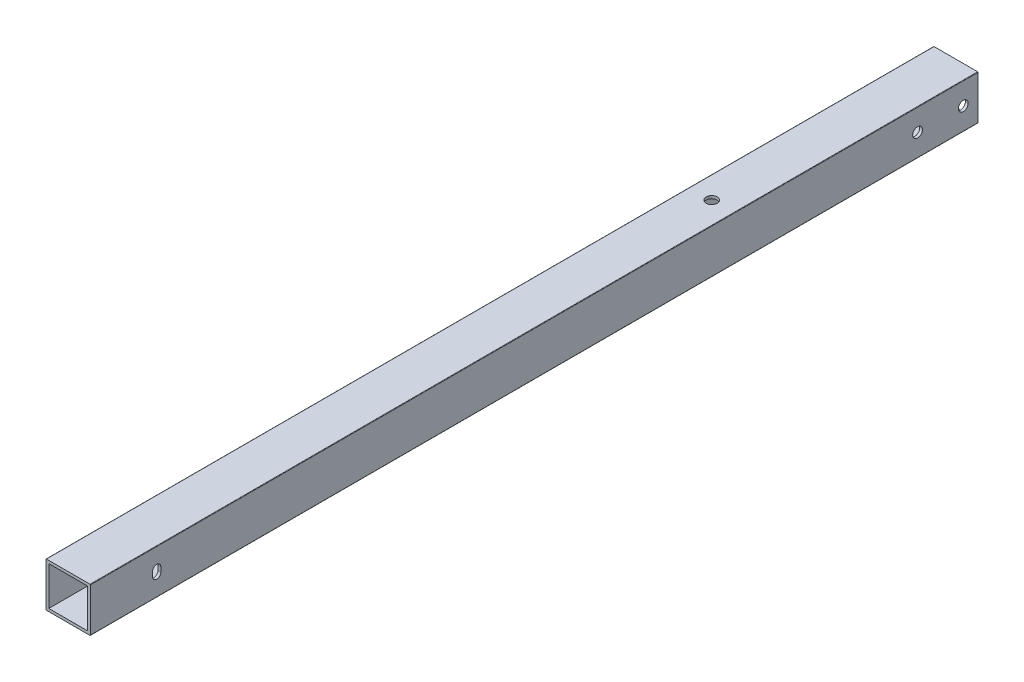
ISO-10303-21;
HEADER;
FILE_DESCRIPTION(('STEP AP214'),'2;1');
FILE_NAME('part.step','',(''),(''),'','','');
FILE_SCHEMA(('AUTOMOTIVE_DESIGN { 1 0 10303 214 1 1 1 1 }'));
ENDSEC;
DATA;
#1=APPLICATION_CONTEXT('core data for automotive mechanical design processes');
#2=APPLICATION_PROTOCOL_DEFINITION('international standard','automotive_design',2000,#1);
#3=PRODUCT_CONTEXT('',#1,'mechanical');
#4=PRODUCT('Part','Part','',(#3));
#5=PRODUCT_RELATED_PRODUCT_CATEGORY('part','',(#4));
#6=PRODUCT_DEFINITION_FORMATION('','',#4);
#7=PRODUCT_DEFINITION_CONTEXT('part definition',#1,'design');
#8=PRODUCT_DEFINITION('design','',#6,#7);
#9=PRODUCT_DEFINITION_SHAPE('','',#8);
#10=(LENGTH_UNIT() NAMED_UNIT(*) SI_UNIT(.MILLI.,.METRE.));
#11=(NAMED_UNIT(*) PLANE_ANGLE_UNIT() SI_UNIT($,.RADIAN.));
#12=(NAMED_UNIT(*) SI_UNIT($,.STERADIAN.) SOLID_ANGLE_UNIT());
#13=UNCERTAINTY_MEASURE_WITH_UNIT(LENGTH_MEASURE(1.E-05),#10,'distance_accuracy_value','');
#14=(GEOMETRIC_REPRESENTATION_CONTEXT(3) GLOBAL_UNCERTAINTY_ASSIGNED_CONTEXT((#13)) GLOBAL_UNIT_ASSIGNED_CONTEXT((#10,
#11,#12)) REPRESENTATION_CONTEXT('',''));
#15=CARTESIAN_POINT('',(0.,0.,0.));
#16=DIRECTION('',(0.,0.,1.));
#17=DIRECTION('',(1.,0.,0.));
#18=AXIS2_PLACEMENT_3D('',#15,#16,#17);
#19=CARTESIAN_POINT('',(-1.33350000000001,-1.3335,-508.));
#20=DIRECTION('',(0.,0.,1.));
#21=DIRECTION('',(-1.,0.,0.));
#22=AXIS2_PLACEMENT_3D('',#19,#20,#21);
#23=CYLINDRICAL_SURFACE('',#22,0.253999999999997);
#24=CARTESIAN_POINT('',(-1.33350000000001,-1.3335,0.));
#25=DIRECTION('',(0.,0.,-1.));
#26=DIRECTION('',(-1.,0.,0.));
#27=AXIS2_PLACEMENT_3D('',#24,#25,#26);
#28=CIRCLE('',#27,0.253999999999997);
#29=CARTESIAN_POINT('',(-1.33350000000001,-1.5875,0.));
#30=VERTEX_POINT('',#29);
#31=CARTESIAN_POINT('',(-1.5875,-1.3335,0.));
#32=VERTEX_POINT('',#31);
#33=EDGE_CURVE('E259',#30,#32,#28,.T.);
#34=ORIENTED_EDGE('',*,*,#33,.T.);
#35=DIRECTION('',(0.,0.,1.));
#36=VECTOR('',#35,1.);
#37=CARTESIAN_POINT('',(-1.5875,-1.3335,-508.));
#38=LINE('',#37,#36);
#39=CARTESIAN_POINT('',(-1.5875,-1.3335,-508.));
#40=VERTEX_POINT('',#39);
#41=EDGE_CURVE('E283',#40,#32,#38,.T.);
#42=ORIENTED_EDGE('',*,*,#41,.F.);
#43=CARTESIAN_POINT('',(-1.33350000000001,-1.3335,-508.));
#44=DIRECTION('',(0.,0.,-1.));
#45=DIRECTION('',(-1.,0.,0.));
#46=AXIS2_PLACEMENT_3D('',#43,#44,#45);
#47=CIRCLE('',#46,0.253999999999997);
#48=CARTESIAN_POINT('',(-1.33350000000001,-1.5875,-508.));
#49=VERTEX_POINT('',#48);
#50=EDGE_CURVE('E265',#49,#40,#47,.T.);
#51=ORIENTED_EDGE('',*,*,#50,.F.);
#52=DIRECTION('',(0.,0.,1.));
#53=VECTOR('',#52,1.);
#54=CARTESIAN_POINT('',(-1.33350000000001,-1.5875,-508.));
#55=LINE('',#54,#53);
#56=EDGE_CURVE('E299',#49,#30,#55,.T.);
#57=ORIENTED_EDGE('',*,*,#56,.T.);
#58=EDGE_LOOP('',(#34,#42,#51,#57));
#59=FACE_BOUND('',#58,.T.);
#60=ADVANCED_FACE('F35',(#59),#23,.T.);
#61=CARTESIAN_POINT('',(23.5585,-1.5875,-508.));
#62=DIRECTION('',(0.,-1.,0.));
#63=DIRECTION('',(1.,0.,0.));
#64=AXIS2_PLACEMENT_3D('',#61,#62,#63);
#65=PLANE('',#64);
#66=CARTESIAN_POINT('',(11.1125,-1.5875,-368.3));
#67=DIRECTION('',(0.,1.,0.));
#68=DIRECTION('',(1.,0.,0.));
#69=AXIS2_PLACEMENT_3D('',#66,#67,#68);
#70=CIRCLE('',#69,3.175);
#71=CARTESIAN_POINT('',(14.2875,-1.5875,-368.3));
#72=VERTEX_POINT('',#71);
#73=EDGE_CURVE('E356',#72,#72,#70,.T.);
#74=ORIENTED_EDGE('',*,*,#73,.T.);
#75=EDGE_LOOP('',(#74));
#76=FACE_BOUND('',#75,.T.);
#77=DIRECTION('',(-1.,0.,0.));
#78=VECTOR('',#77,1.);
#79=CARTESIAN_POINT('',(23.5585,-1.5875,0.));
#80=LINE('',#79,#78);
#81=CARTESIAN_POINT('',(23.5585,-1.5875,0.));
#82=VERTEX_POINT('',#81);
#83=EDGE_CURVE('E269',#82,#30,#80,.T.);
#84=ORIENTED_EDGE('',*,*,#83,.T.);
#85=ORIENTED_EDGE('',*,*,#56,.F.);
#86=DIRECTION('',(-1.,0.,0.));
#87=VECTOR('',#86,1.);
#88=CARTESIAN_POINT('',(23.5585,-1.5875,-508.));
#89=LINE('',#88,#87);
#90=CARTESIAN_POINT('',(23.5585,-1.5875,-508.));
#91=VERTEX_POINT('',#90);
#92=EDGE_CURVE('E281',#91,#49,#89,.T.);
#93=ORIENTED_EDGE('',*,*,#92,.F.);
#94=DIRECTION('',(0.,0.,1.));
#95=VECTOR('',#94,1.);
#96=CARTESIAN_POINT('',(23.5585,-1.5875,-508.));
#97=LINE('',#96,#95);
#98=EDGE_CURVE('E303',#91,#82,#97,.T.);
#99=ORIENTED_EDGE('',*,*,#98,.T.);
#100=EDGE_LOOP('',(#84,#85,#93,#99));
#101=FACE_BOUND('',#100,.T.);
#102=ADVANCED_FACE('F407',(#76,#101),#65,.T.);
#103=CARTESIAN_POINT('',(23.5585,-1.3335,-508.));
#104=DIRECTION('',(0.,0.,1.));
#105=DIRECTION('',(-1.,0.,0.));
#106=AXIS2_PLACEMENT_3D('',#103,#104,#105);
#107=CYLINDRICAL_SURFACE('',#106,0.253999999999998);
#108=CARTESIAN_POINT('',(23.5585,-1.3335,0.));
#109=DIRECTION('',(0.,0.,-1.));
#110=DIRECTION('',(-1.,0.,0.));
#111=AXIS2_PLACEMENT_3D('',#108,#109,#110);
#112=CIRCLE('',#111,0.253999999999998);
#113=CARTESIAN_POINT('',(23.8125,-1.3335,0.));
#114=VERTEX_POINT('',#113);
#115=EDGE_CURVE('E296',#114,#82,#112,.T.);
#116=ORIENTED_EDGE('',*,*,#115,.T.);
#117=ORIENTED_EDGE('',*,*,#98,.F.);
#118=CARTESIAN_POINT('',(23.5585,-1.3335,-508.));
#119=DIRECTION('',(0.,0.,-1.));
#120=DIRECTION('',(-1.,0.,0.));
#121=AXIS2_PLACEMENT_3D('',#118,#119,#120);
#122=CIRCLE('',#121,0.253999999999998);
#123=CARTESIAN_POINT('',(23.8125,-1.3335,-508.));
#124=VERTEX_POINT('',#123);
#125=EDGE_CURVE('E279',#124,#91,#122,.T.);
#126=ORIENTED_EDGE('',*,*,#125,.F.);
#127=DIRECTION('',(0.,0.,1.));
#128=VECTOR('',#127,1.);
#129=CARTESIAN_POINT('',(23.8125,-1.3335,-508.));
#130=LINE('',#129,#128);
#131=EDGE_CURVE('E306',#124,#114,#130,.T.);
#132=ORIENTED_EDGE('',*,*,#131,.T.);
#133=EDGE_LOOP('',(#116,#117,#126,#132));
#134=FACE_BOUND('',#133,.T.);
#135=ADVANCED_FACE('F412',(#134),#107,.T.);
#136=CARTESIAN_POINT('',(23.8125,23.5585,-508.));
#137=DIRECTION('',(1.,0.,0.));
#138=DIRECTION('',(0.,1.,0.));
#139=AXIS2_PLACEMENT_3D('',#136,#137,#138);
#140=PLANE('',#139);
#141=CARTESIAN_POINT('',(23.8125,11.1709689102206,-499.577288815066));
#142=DIRECTION('',(-1.,0.,0.));
#143=DIRECTION('',(0.,1.,0.));
#144=AXIS2_PLACEMENT_3D('',#141,#142,#143);
#145=CIRCLE('',#144,2.79399999999998);
#146=CARTESIAN_POINT('',(23.8125,13.9649689102206,-499.577288815066));
#147=VERTEX_POINT('',#146);
#148=EDGE_CURVE('E349',#147,#147,#145,.T.);
#149=ORIENTED_EDGE('',*,*,#148,.T.);
#150=EDGE_LOOP('',(#149));
#151=FACE_BOUND('',#150,.T.);
#152=CARTESIAN_POINT('',(23.8125,11.1709689102206,-473.415288815066));
#153=DIRECTION('',(-1.,0.,0.));
#154=DIRECTION('',(0.,1.,0.));
#155=AXIS2_PLACEMENT_3D('',#152,#153,#154);
#156=CIRCLE('',#155,2.79399999999998);
#157=CARTESIAN_POINT('',(23.8125,13.9649689102206,-473.415288815066));
#158=VERTEX_POINT('',#157);
#159=EDGE_CURVE('E342',#158,#158,#156,.T.);
#160=ORIENTED_EDGE('',*,*,#159,.T.);
#161=EDGE_LOOP('',(#160));
#162=FACE_BOUND('',#161,.T.);
#163=CARTESIAN_POINT('',(23.8125,9.8425,-37.933268304));
#164=DIRECTION('',(-1.,0.,0.));
#165=DIRECTION('',(0.,1.,0.));
#166=AXIS2_PLACEMENT_3D('',#163,#164,#165);
#167=CIRCLE('',#166,2.38125);
#168=CARTESIAN_POINT('',(23.8125,9.8425,-40.314518304));
#169=VERTEX_POINT('',#168);
#170=CARTESIAN_POINT('',(23.8125,9.8425,-35.552018304));
#171=VERTEX_POINT('',#170);
#172=EDGE_CURVE('E206',#169,#171,#167,.T.);
#173=ORIENTED_EDGE('',*,*,#172,.T.);
#174=DIRECTION('',(0.,1.,0.));
#175=VECTOR('',#174,1.);
#176=CARTESIAN_POINT('',(23.8125,0.,-35.552018304));
#177=LINE('',#176,#175);
#178=CARTESIAN_POINT('',(23.8125,12.3825,-35.552018304));
#179=VERTEX_POINT('',#178);
#180=EDGE_CURVE('E210',#171,#179,#177,.T.);
#181=ORIENTED_EDGE('',*,*,#180,.T.);
#182=CARTESIAN_POINT('',(23.8125,12.3825,-37.933268304));
#183=DIRECTION('',(-1.,0.,0.));
#184=DIRECTION('',(0.,1.,0.));
#185=AXIS2_PLACEMENT_3D('',#182,#183,#184);
#186=CIRCLE('',#185,2.38125);
#187=CARTESIAN_POINT('',(23.8125,12.3825,-40.314518304));
#188=VERTEX_POINT('',#187);
#189=EDGE_CURVE('E191',#179,#188,#186,.T.);
#190=ORIENTED_EDGE('',*,*,#189,.T.);
#191=DIRECTION('',(0.,1.,0.));
#192=VECTOR('',#191,1.);
#193=CARTESIAN_POINT('',(23.8125,0.,-40.314518304));
#194=LINE('',#193,#192);
#195=EDGE_CURVE('E203',#169,#188,#194,.T.);
#196=ORIENTED_EDGE('',*,*,#195,.F.);
#197=EDGE_LOOP('',(#173,#181,#190,#196));
#198=FACE_BOUND('',#197,.T.);
#199=DIRECTION('',(0.,-1.,0.));
#200=VECTOR('',#199,1.);
#201=CARTESIAN_POINT('',(23.8125,23.5585,0.));
#202=LINE('',#201,#200);
#203=CARTESIAN_POINT('',(23.8125,23.5585,0.));
#204=VERTEX_POINT('',#203);
#205=EDGE_CURVE('E294',#204,#114,#202,.T.);
#206=ORIENTED_EDGE('',*,*,#205,.T.);
#207=ORIENTED_EDGE('',*,*,#131,.F.);
#208=DIRECTION('',(0.,-1.,0.));
#209=VECTOR('',#208,1.);
#210=CARTESIAN_POINT('',(23.8125,23.5585,-508.));
#211=LINE('',#210,#209);
#212=CARTESIAN_POINT('',(23.8125,23.5585,-508.));
#213=VERTEX_POINT('',#212);
#214=EDGE_CURVE('E277',#213,#124,#211,.T.);
#215=ORIENTED_EDGE('',*,*,#214,.F.);
#216=DIRECTION('',(0.,0.,1.));
#217=VECTOR('',#216,1.);
#218=CARTESIAN_POINT('',(23.8125,23.5585,-508.));
#219=LINE('',#218,#217);
#220=EDGE_CURVE('E309',#213,#204,#219,.T.);
#221=ORIENTED_EDGE('',*,*,#220,.T.);
#222=EDGE_LOOP('',(#206,#207,#215,#221));
#223=FACE_BOUND('',#222,.T.);
#224=ADVANCED_FACE('F434',(#151,#162,#198,#223),#140,.T.);
#225=CARTESIAN_POINT('',(23.5585,23.5585,-508.));
#226=DIRECTION('',(0.,0.,1.));
#227=DIRECTION('',(-1.,0.,0.));
#228=AXIS2_PLACEMENT_3D('',#225,#226,#227);
#229=CYLINDRICAL_SURFACE('',#228,0.254000000000001);
#230=CARTESIAN_POINT('',(23.5585,23.5585,0.));
#231=DIRECTION('',(0.,0.,-1.));
#232=DIRECTION('',(-1.,0.,0.));
#233=AXIS2_PLACEMENT_3D('',#230,#231,#232);
#234=CIRCLE('',#233,0.254000000000001);
#235=CARTESIAN_POINT('',(23.5585,23.8125,0.));
#236=VERTEX_POINT('',#235);
#237=EDGE_CURVE('E292',#236,#204,#234,.T.);
#238=ORIENTED_EDGE('',*,*,#237,.T.);
#239=ORIENTED_EDGE('',*,*,#220,.F.);
#240=CARTESIAN_POINT('',(23.5585,23.5585,-508.));
#241=DIRECTION('',(0.,0.,-1.));
#242=DIRECTION('',(-1.,0.,0.));
#243=AXIS2_PLACEMENT_3D('',#240,#241,#242);
#244=CIRCLE('',#243,0.254000000000001);
#245=CARTESIAN_POINT('',(23.5585,23.8125,-508.));
#246=VERTEX_POINT('',#245);
#247=EDGE_CURVE('E275',#246,#213,#244,.T.);
#248=ORIENTED_EDGE('',*,*,#247,.F.);
#249=DIRECTION('',(0.,0.,1.));
#250=VECTOR('',#249,1.);
#251=CARTESIAN_POINT('',(23.5585,23.8125,-508.));
#252=LINE('',#251,#250);
#253=EDGE_CURVE('E312',#246,#236,#252,.T.);
#254=ORIENTED_EDGE('',*,*,#253,.T.);
#255=EDGE_LOOP('',(#238,#239,#248,#254));
#256=FACE_BOUND('',#255,.T.);
#257=ADVANCED_FACE('F439',(#256),#229,.T.);
#258=CARTESIAN_POINT('',(-1.33350000000001,23.8125,-508.));
#259=DIRECTION('',(0.,1.,0.));
#260=DIRECTION('',(0.,0.,-1.));
#261=AXIS2_PLACEMENT_3D('',#258,#259,#260);
#262=PLANE('',#261);
#263=CARTESIAN_POINT('',(11.1125,23.8125,-368.3));
#264=DIRECTION('',(0.,1.,0.));
#265=DIRECTION('',(1.,0.,0.));
#266=AXIS2_PLACEMENT_3D('',#263,#264,#265);
#267=CIRCLE('',#266,3.175);
#268=CARTESIAN_POINT('',(14.2875,23.8125,-368.3));
#269=VERTEX_POINT('',#268);
#270=EDGE_CURVE('E359',#269,#269,#267,.T.);
#271=ORIENTED_EDGE('',*,*,#270,.F.);
#272=EDGE_LOOP('',(#271));
#273=FACE_BOUND('',#272,.T.);
#274=DIRECTION('',(1.,0.,0.));
#275=VECTOR('',#274,1.);
#276=CARTESIAN_POINT('',(-1.33350000000001,23.8125,0.));
#277=LINE('',#276,#275);
#278=CARTESIAN_POINT('',(-1.33350000000001,23.8125,0.));
#279=VERTEX_POINT('',#278);
#280=EDGE_CURVE('E290',#279,#236,#277,.T.);
#281=ORIENTED_EDGE('',*,*,#280,.T.);
#282=ORIENTED_EDGE('',*,*,#253,.F.);
#283=DIRECTION('',(1.,0.,0.));
#284=VECTOR('',#283,1.);
#285=CARTESIAN_POINT('',(-1.33350000000001,23.8125,-508.));
#286=LINE('',#285,#284);
#287=CARTESIAN_POINT('',(-1.33350000000001,23.8125,-508.));
#288=VERTEX_POINT('',#287);
#289=EDGE_CURVE('E273',#288,#246,#286,.T.);
#290=ORIENTED_EDGE('',*,*,#289,.F.);
#291=DIRECTION('',(0.,0.,1.));
#292=VECTOR('',#291,1.);
#293=CARTESIAN_POINT('',(-1.33350000000001,23.8125,-508.));
#294=LINE('',#293,#292);
#295=EDGE_CURVE('E315',#288,#279,#294,.T.);
#296=ORIENTED_EDGE('',*,*,#295,.T.);
#297=EDGE_LOOP('',(#281,#282,#290,#296));
#298=FACE_BOUND('',#297,.T.);
#299=ADVANCED_FACE('F443',(#273,#298),#262,.T.);
#300=CARTESIAN_POINT('',(-1.33350000000001,23.5585,-508.));
#301=DIRECTION('',(0.,0.,1.));
#302=DIRECTION('',(-1.,0.,0.));
#303=AXIS2_PLACEMENT_3D('',#300,#301,#302);
#304=CYLINDRICAL_SURFACE('',#303,0.253999999999992);
#305=CARTESIAN_POINT('',(-1.33350000000001,23.5585,0.));
#306=DIRECTION('',(0.,0.,-1.));
#307=DIRECTION('',(-1.,0.,0.));
#308=AXIS2_PLACEMENT_3D('',#305,#306,#307);
#309=CIRCLE('',#308,0.253999999999992);
#310=CARTESIAN_POINT('',(-1.5875,23.5585,0.));
#311=VERTEX_POINT('',#310);
#312=EDGE_CURVE('E288',#311,#279,#309,.T.);
#313=ORIENTED_EDGE('',*,*,#312,.T.);
#314=ORIENTED_EDGE('',*,*,#295,.F.);
#315=CARTESIAN_POINT('',(-1.33350000000001,23.5585,-508.));
#316=DIRECTION('',(0.,0.,-1.));
#317=DIRECTION('',(-1.,0.,0.));
#318=AXIS2_PLACEMENT_3D('',#315,#316,#317);
#319=CIRCLE('',#318,0.253999999999992);
#320=CARTESIAN_POINT('',(-1.5875,23.5585,-508.));
#321=VERTEX_POINT('',#320);
#322=EDGE_CURVE('E271',#321,#288,#319,.T.);
#323=ORIENTED_EDGE('',*,*,#322,.F.);
#324=DIRECTION('',(0.,0.,1.));
#325=VECTOR('',#324,1.);
#326=CARTESIAN_POINT('',(-1.5875,23.5585,-508.));
#327=LINE('',#326,#325);
#328=EDGE_CURVE('E318',#321,#311,#327,.T.);
#329=ORIENTED_EDGE('',*,*,#328,.T.);
#330=EDGE_LOOP('',(#313,#314,#323,#329));
#331=FACE_BOUND('',#330,.T.);
#332=ADVANCED_FACE('F446',(#331),#304,.T.);
#333=CARTESIAN_POINT('',(-1.5875,-1.3335,-508.));
#334=DIRECTION('',(-1.,0.,0.));
#335=DIRECTION('',(0.,-1.,0.));
#336=AXIS2_PLACEMENT_3D('',#333,#334,#335);
#337=PLANE('',#336);
#338=CARTESIAN_POINT('',(-1.5875,11.1709689102206,-499.577288815066));
#339=DIRECTION('',(-1.,0.,0.));
#340=DIRECTION('',(0.,1.,0.));
#341=AXIS2_PLACEMENT_3D('',#338,#339,#340);
#342=CIRCLE('',#341,2.79399999999998);
#343=CARTESIAN_POINT('',(-1.5875,13.9649689102206,-499.577288815066));
#344=VERTEX_POINT('',#343);
#345=EDGE_CURVE('E331',#344,#344,#342,.T.);
#346=ORIENTED_EDGE('',*,*,#345,.F.);
#347=EDGE_LOOP('',(#346));
#348=FACE_BOUND('',#347,.T.);
#349=CARTESIAN_POINT('',(-1.5875,11.1709689102206,-473.415288815066));
#350=DIRECTION('',(-1.,0.,0.));
#351=DIRECTION('',(0.,1.,0.));
#352=AXIS2_PLACEMENT_3D('',#349,#350,#351);
#353=CIRCLE('',#352,2.79399999999998);
#354=CARTESIAN_POINT('',(-1.5875,13.9649689102206,-473.415288815066));
#355=VERTEX_POINT('',#354);
#356=EDGE_CURVE('E345',#355,#355,#353,.T.);
#357=ORIENTED_EDGE('',*,*,#356,.F.);
#358=EDGE_LOOP('',(#357));
#359=FACE_BOUND('',#358,.T.);
#360=CARTESIAN_POINT('',(-1.58750000000001,9.84250000000001,-37.933268304));
#361=DIRECTION('',(-1.,0.,0.));
#362=DIRECTION('',(0.,1.,0.));
#363=AXIS2_PLACEMENT_3D('',#360,#361,#362);
#364=CIRCLE('',#363,2.38125);
#365=CARTESIAN_POINT('',(-1.58750000000001,9.84250000000001,-40.314518304));
#366=VERTEX_POINT('',#365);
#367=CARTESIAN_POINT('',(-1.58750000000001,9.84250000000001,-35.552018304));
#368=VERTEX_POINT('',#367);
#369=EDGE_CURVE('E178',#366,#368,#364,.T.);
#370=ORIENTED_EDGE('',*,*,#369,.F.);
#371=DIRECTION('',(0.,1.,0.));
#372=VECTOR('',#371,1.);
#373=CARTESIAN_POINT('',(-1.58750000000001,0.,-40.314518304));
#374=LINE('',#373,#372);
#375=CARTESIAN_POINT('',(-1.58750000000001,12.3825,-40.314518304));
#376=VERTEX_POINT('',#375);
#377=EDGE_CURVE('E186',#366,#376,#374,.T.);
#378=ORIENTED_EDGE('',*,*,#377,.T.);
#379=CARTESIAN_POINT('',(-1.58750000000001,12.3825,-37.933268304));
#380=DIRECTION('',(-1.,0.,0.));
#381=DIRECTION('',(0.,1.,0.));
#382=AXIS2_PLACEMENT_3D('',#379,#380,#381);
#383=CIRCLE('',#382,2.38125);
#384=CARTESIAN_POINT('',(-1.5875,12.3825,-35.552018304));
#385=VERTEX_POINT('',#384);
#386=EDGE_CURVE('E198',#385,#376,#383,.T.);
#387=ORIENTED_EDGE('',*,*,#386,.F.);
#388=DIRECTION('',(0.,1.,0.));
#389=VECTOR('',#388,1.);
#390=CARTESIAN_POINT('',(-1.58750000000001,0.,-35.552018304));
#391=LINE('',#390,#389);
#392=EDGE_CURVE('E196',#368,#385,#391,.T.);
#393=ORIENTED_EDGE('',*,*,#392,.F.);
#394=EDGE_LOOP('',(#370,#378,#387,#393));
#395=FACE_BOUND('',#394,.T.);
#396=DIRECTION('',(0.,1.,0.));
#397=VECTOR('',#396,1.);
#398=CARTESIAN_POINT('',(-1.5875,-1.3335,0.));
#399=LINE('',#398,#397);
#400=EDGE_CURVE('E286',#32,#311,#399,.T.);
#401=ORIENTED_EDGE('',*,*,#400,.T.);
#402=ORIENTED_EDGE('',*,*,#328,.F.);
#403=DIRECTION('',(0.,1.,0.));
#404=VECTOR('',#403,1.);
#405=CARTESIAN_POINT('',(-1.5875,-1.3335,-508.));
#406=LINE('',#405,#404);
#407=EDGE_CURVE('E268',#40,#321,#406,.T.);
#408=ORIENTED_EDGE('',*,*,#407,.F.);
#409=ORIENTED_EDGE('',*,*,#41,.T.);
#410=EDGE_LOOP('',(#401,#402,#408,#409));
#411=FACE_BOUND('',#410,.T.);
#412=ADVANCED_FACE('F194',(#348,#359,#395,#411),#337,.T.);
#413=CARTESIAN_POINT('',(-1.33350000000001,-1.3335,-508.));
#414=DIRECTION('',(0.,0.,1.));
#415=DIRECTION('',(-1.,0.,0.));
#416=AXIS2_PLACEMENT_3D('',#413,#414,#415);
#417=PLANE('',#416);
#418=DIRECTION('',(1.,0.,0.));
#419=VECTOR('',#418,1.);
#420=CARTESIAN_POINT('',(0.,22.225,-508.));
#421=LINE('',#420,#419);
#422=CARTESIAN_POINT('',(0.,22.225,-508.));
#423=VERTEX_POINT('',#422);
#424=CARTESIAN_POINT('',(22.225,22.225,-508.));
#425=VERTEX_POINT('',#424);
#426=EDGE_CURVE('E243',#423,#425,#421,.T.);
#427=ORIENTED_EDGE('',*,*,#426,.F.);
#428=DIRECTION('',(0.,1.,0.));
#429=VECTOR('',#428,1.);
#430=CARTESIAN_POINT('',(0.,22.225,-508.));
#431=LINE('',#430,#429);
#432=CARTESIAN_POINT('',(0.,0.,-508.));
#433=VERTEX_POINT('',#432);
#434=EDGE_CURVE('E240',#433,#423,#431,.T.);
#435=ORIENTED_EDGE('',*,*,#434,.F.);
#436=DIRECTION('',(-1.,0.,0.));
#437=VECTOR('',#436,1.);
#438=CARTESIAN_POINT('',(0.,0.,-508.));
#439=LINE('',#438,#437);
#440=CARTESIAN_POINT('',(22.225,0.,-508.));
#441=VERTEX_POINT('',#440);
#442=EDGE_CURVE('E236',#441,#433,#439,.T.);
#443=ORIENTED_EDGE('',*,*,#442,.F.);
#444=DIRECTION('',(0.,-1.,0.));
#445=VECTOR('',#444,1.);
#446=CARTESIAN_POINT('',(22.225,22.225,-508.));
#447=LINE('',#446,#445);
#448=EDGE_CURVE('E233',#425,#441,#447,.T.);
#449=ORIENTED_EDGE('',*,*,#448,.F.);
#450=EDGE_LOOP('',(#427,#435,#443,#449));
#451=FACE_BOUND('',#450,.T.);
#452=ORIENTED_EDGE('',*,*,#50,.T.);
#453=ORIENTED_EDGE('',*,*,#407,.T.);
#454=ORIENTED_EDGE('',*,*,#322,.T.);
#455=ORIENTED_EDGE('',*,*,#289,.T.);
#456=ORIENTED_EDGE('',*,*,#247,.T.);
#457=ORIENTED_EDGE('',*,*,#214,.T.);
#458=ORIENTED_EDGE('',*,*,#125,.T.);
#459=ORIENTED_EDGE('',*,*,#92,.T.);
#460=EDGE_LOOP('',(#452,#453,#454,#455,#456,#457,#458,#459));
#461=FACE_BOUND('',#460,.T.);
#462=ADVANCED_FACE('F388',(#451,#461),#417,.F.);
#463=CARTESIAN_POINT('',(-1.33350000000001,-1.3335,0.));
#464=DIRECTION('',(0.,0.,1.));
#465=DIRECTION('',(-1.,0.,0.));
#466=AXIS2_PLACEMENT_3D('',#463,#464,#465);
#467=PLANE('',#466);
#468=DIRECTION('',(0.,-1.,0.));
#469=VECTOR('',#468,1.);
#470=CARTESIAN_POINT('',(22.225,22.225,0.));
#471=LINE('',#470,#469);
#472=CARTESIAN_POINT('',(22.225,22.225,0.));
#473=VERTEX_POINT('',#472);
#474=CARTESIAN_POINT('',(22.225,0.,0.));
#475=VERTEX_POINT('',#474);
#476=EDGE_CURVE('E232',#473,#475,#471,.T.);
#477=ORIENTED_EDGE('',*,*,#476,.T.);
#478=DIRECTION('',(-1.,0.,0.));
#479=VECTOR('',#478,1.);
#480=CARTESIAN_POINT('',(0.,0.,0.));
#481=LINE('',#480,#479);
#482=CARTESIAN_POINT('',(0.,0.,0.));
#483=VERTEX_POINT('',#482);
#484=EDGE_CURVE('E249',#475,#483,#481,.T.);
#485=ORIENTED_EDGE('',*,*,#484,.T.);
#486=DIRECTION('',(0.,1.,0.));
#487=VECTOR('',#486,1.);
#488=CARTESIAN_POINT('',(0.,22.225,0.));
#489=LINE('',#488,#487);
#490=CARTESIAN_POINT('',(0.,22.225,0.));
#491=VERTEX_POINT('',#490);
#492=EDGE_CURVE('E252',#483,#491,#489,.T.);
#493=ORIENTED_EDGE('',*,*,#492,.T.);
#494=DIRECTION('',(1.,0.,0.));
#495=VECTOR('',#494,1.);
#496=CARTESIAN_POINT('',(0.,22.225,0.));
#497=LINE('',#496,#495);
#498=EDGE_CURVE('E237',#491,#473,#497,.T.);
#499=ORIENTED_EDGE('',*,*,#498,.T.);
#500=EDGE_LOOP('',(#477,#485,#493,#499));
#501=FACE_BOUND('',#500,.T.);
#502=ORIENTED_EDGE('',*,*,#33,.F.);
#503=ORIENTED_EDGE('',*,*,#83,.F.);
#504=ORIENTED_EDGE('',*,*,#115,.F.);
#505=ORIENTED_EDGE('',*,*,#205,.F.);
#506=ORIENTED_EDGE('',*,*,#237,.F.);
#507=ORIENTED_EDGE('',*,*,#280,.F.);
#508=ORIENTED_EDGE('',*,*,#312,.F.);
#509=ORIENTED_EDGE('',*,*,#400,.F.);
#510=EDGE_LOOP('',(#502,#503,#504,#505,#506,#507,#508,#509));
#511=FACE_BOUND('',#510,.T.);
#512=ADVANCED_FACE('F378',(#501,#511),#467,.T.);
#513=CARTESIAN_POINT('',(22.225,22.225,-508.));
#514=DIRECTION('',(1.,0.,0.));
#515=DIRECTION('',(0.,1.,0.));
#516=AXIS2_PLACEMENT_3D('',#513,#514,#515);
#517=PLANE('',#516);
#518=CARTESIAN_POINT('',(22.225,11.1709689102206,-499.577288815066));
#519=DIRECTION('',(-1.,0.,0.));
#520=DIRECTION('',(0.,1.,0.));
#521=AXIS2_PLACEMENT_3D('',#518,#519,#520);
#522=CIRCLE('',#521,2.79399999999998);
#523=CARTESIAN_POINT('',(22.225,13.9649689102206,-499.577288815066));
#524=VERTEX_POINT('',#523);
#525=EDGE_CURVE('E207',#524,#524,#522,.T.);
#526=ORIENTED_EDGE('',*,*,#525,.F.);
#527=EDGE_LOOP('',(#526));
#528=FACE_BOUND('',#527,.T.);
#529=CARTESIAN_POINT('',(22.225,11.1709689102206,-473.415288815066));
#530=DIRECTION('',(-1.,0.,0.));
#531=DIRECTION('',(0.,1.,0.));
#532=AXIS2_PLACEMENT_3D('',#529,#530,#531);
#533=CIRCLE('',#532,2.79399999999998);
#534=CARTESIAN_POINT('',(22.225,13.9649689102206,-473.415288815066));
#535=VERTEX_POINT('',#534);
#536=EDGE_CURVE('E330',#535,#535,#533,.T.);
#537=ORIENTED_EDGE('',*,*,#536,.F.);
#538=EDGE_LOOP('',(#537));
#539=FACE_BOUND('',#538,.T.);
#540=DIRECTION('',(0.,1.,0.));
#541=VECTOR('',#540,1.);
#542=CARTESIAN_POINT('',(22.225,22.225,-40.314518304));
#543=LINE('',#542,#541);
#544=CARTESIAN_POINT('',(22.225,9.8425,-40.314518304));
#545=VERTEX_POINT('',#544);
#546=CARTESIAN_POINT('',(22.225,12.3825,-40.314518304));
#547=VERTEX_POINT('',#546);
#548=EDGE_CURVE('E227',#545,#547,#543,.T.);
#549=ORIENTED_EDGE('',*,*,#548,.T.);
#550=CARTESIAN_POINT('',(22.225,12.3825,-37.933268304));
#551=DIRECTION('',(-1.,0.,0.));
#552=DIRECTION('',(0.,1.,0.));
#553=AXIS2_PLACEMENT_3D('',#550,#551,#552);
#554=CIRCLE('',#553,2.38125);
#555=CARTESIAN_POINT('',(22.225,12.3825,-35.552018304));
#556=VERTEX_POINT('',#555);
#557=EDGE_CURVE('E224',#556,#547,#554,.T.);
#558=ORIENTED_EDGE('',*,*,#557,.F.);
#559=DIRECTION('',(0.,1.,0.));
#560=VECTOR('',#559,1.);
#561=CARTESIAN_POINT('',(22.225,22.225,-35.552018304));
#562=LINE('',#561,#560);
#563=CARTESIAN_POINT('',(22.225,9.8425,-35.552018304));
#564=VERTEX_POINT('',#563);
#565=EDGE_CURVE('E216',#564,#556,#562,.T.);
#566=ORIENTED_EDGE('',*,*,#565,.F.);
#567=CARTESIAN_POINT('',(22.225,9.8425,-37.933268304));
#568=DIRECTION('',(-1.,0.,0.));
#569=DIRECTION('',(0.,1.,0.));
#570=AXIS2_PLACEMENT_3D('',#567,#568,#569);
#571=CIRCLE('',#570,2.38125);
#572=EDGE_CURVE('E230',#545,#564,#571,.T.);
#573=ORIENTED_EDGE('',*,*,#572,.F.);
#574=EDGE_LOOP('',(#549,#558,#566,#573));
#575=FACE_BOUND('',#574,.T.);
#576=ORIENTED_EDGE('',*,*,#476,.F.);
#577=DIRECTION('',(0.,0.,1.));
#578=VECTOR('',#577,1.);
#579=CARTESIAN_POINT('',(22.225,22.225,-508.));
#580=LINE('',#579,#578);
#581=EDGE_CURVE('E257',#425,#473,#580,.T.);
#582=ORIENTED_EDGE('',*,*,#581,.F.);
#583=ORIENTED_EDGE('',*,*,#448,.T.);
#584=DIRECTION('',(0.,0.,1.));
#585=VECTOR('',#584,1.);
#586=CARTESIAN_POINT('',(22.225,0.,-508.));
#587=LINE('',#586,#585);
#588=EDGE_CURVE('E246',#441,#475,#587,.T.);
#589=ORIENTED_EDGE('',*,*,#588,.T.);
#590=EDGE_LOOP('',(#576,#582,#583,#589));
#591=FACE_BOUND('',#590,.T.);
#592=ADVANCED_FACE('F382',(#528,#539,#575,#591),#517,.F.);
#593=CARTESIAN_POINT('',(0.,22.225,-508.));
#594=DIRECTION('',(0.,1.,0.));
#595=DIRECTION('',(-1.,0.,0.));
#596=AXIS2_PLACEMENT_3D('',#593,#594,#595);
#597=PLANE('',#596);
#598=CARTESIAN_POINT('',(11.1125,22.225,-368.3));
#599=DIRECTION('',(0.,-1.,0.));
#600=DIRECTION('',(-1.,0.,0.));
#601=AXIS2_PLACEMENT_3D('',#598,#599,#600);
#602=CIRCLE('',#601,3.175);
#603=CARTESIAN_POINT('',(14.2875,22.225,-368.3));
#604=VERTEX_POINT('',#603);
#605=EDGE_CURVE('E346',#604,#604,#602,.T.);
#606=ORIENTED_EDGE('',*,*,#605,.F.);
#607=EDGE_LOOP('',(#606));
#608=FACE_BOUND('',#607,.T.);
#609=ORIENTED_EDGE('',*,*,#498,.F.);
#610=DIRECTION('',(0.,0.,1.));
#611=VECTOR('',#610,1.);
#612=CARTESIAN_POINT('',(0.,22.225,-508.));
#613=LINE('',#612,#611);
#614=EDGE_CURVE('E260',#423,#491,#613,.T.);
#615=ORIENTED_EDGE('',*,*,#614,.F.);
#616=ORIENTED_EDGE('',*,*,#426,.T.);
#617=ORIENTED_EDGE('',*,*,#581,.T.);
#618=EDGE_LOOP('',(#609,#615,#616,#617));
#619=FACE_BOUND('',#618,.T.);
#620=ADVANCED_FACE('F392',(#608,#619),#597,.F.);
#621=CARTESIAN_POINT('',(0.,22.225,-508.));
#622=DIRECTION('',(-1.,0.,0.));
#623=DIRECTION('',(0.,-1.,0.));
#624=AXIS2_PLACEMENT_3D('',#621,#622,#623);
#625=PLANE('',#624);
#626=CARTESIAN_POINT('',(0.,11.1709689102206,-499.577288815066));
#627=DIRECTION('',(1.,0.,0.));
#628=DIRECTION('',(0.,-1.,0.));
#629=AXIS2_PLACEMENT_3D('',#626,#627,#628);
#630=CIRCLE('',#629,2.79399999999998);
#631=CARTESIAN_POINT('',(0.,8.37696891022065,-499.577288815066));
#632=VERTEX_POINT('',#631);
#633=EDGE_CURVE('E332',#632,#632,#630,.T.);
#634=ORIENTED_EDGE('',*,*,#633,.F.);
#635=EDGE_LOOP('',(#634));
#636=FACE_BOUND('',#635,.T.);
#637=CARTESIAN_POINT('',(0.,11.1709689102206,-473.415288815066));
#638=DIRECTION('',(1.,0.,0.));
#639=DIRECTION('',(0.,-1.,0.));
#640=AXIS2_PLACEMENT_3D('',#637,#638,#639);
#641=CIRCLE('',#640,2.79399999999998);
#642=CARTESIAN_POINT('',(0.,8.37696891022065,-473.415288815066));
#643=VERTEX_POINT('',#642);
#644=EDGE_CURVE('E328',#643,#643,#641,.T.);
#645=ORIENTED_EDGE('',*,*,#644,.F.);
#646=EDGE_LOOP('',(#645));
#647=FACE_BOUND('',#646,.T.);
#648=DIRECTION('',(0.,-1.,0.));
#649=VECTOR('',#648,1.);
#650=CARTESIAN_POINT('',(0.,22.225,-35.552018304));
#651=LINE('',#650,#649);
#652=CARTESIAN_POINT('',(0.,12.3825,-35.552018304));
#653=VERTEX_POINT('',#652);
#654=CARTESIAN_POINT('',(0.,9.8425,-35.552018304));
#655=VERTEX_POINT('',#654);
#656=EDGE_CURVE('E302',#653,#655,#651,.T.);
#657=ORIENTED_EDGE('',*,*,#656,.F.);
#658=CARTESIAN_POINT('',(0.,12.3825,-37.933268304));
#659=DIRECTION('',(1.,0.,0.));
#660=DIRECTION('',(0.,-1.,0.));
#661=AXIS2_PLACEMENT_3D('',#658,#659,#660);
#662=CIRCLE('',#661,2.38125);
#663=CARTESIAN_POINT('',(0.,12.3825,-40.314518304));
#664=VERTEX_POINT('',#663);
#665=EDGE_CURVE('E325',#664,#653,#662,.T.);
#666=ORIENTED_EDGE('',*,*,#665,.F.);
#667=DIRECTION('',(0.,-1.,0.));
#668=VECTOR('',#667,1.);
#669=CARTESIAN_POINT('',(0.,22.225,-40.314518304));
#670=LINE('',#669,#668);
#671=CARTESIAN_POINT('',(0.,9.84250000000001,-40.314518304));
#672=VERTEX_POINT('',#671);
#673=EDGE_CURVE('E43',#664,#672,#670,.T.);
#674=ORIENTED_EDGE('',*,*,#673,.T.);
#675=CARTESIAN_POINT('',(0.,9.84250000000001,-37.933268304));
#676=DIRECTION('',(1.,0.,0.));
#677=DIRECTION('',(0.,-1.,0.));
#678=AXIS2_PLACEMENT_3D('',#675,#676,#677);
#679=CIRCLE('',#678,2.38125);
#680=EDGE_CURVE('E11',#655,#672,#679,.T.);
#681=ORIENTED_EDGE('',*,*,#680,.F.);
#682=EDGE_LOOP('',(#657,#666,#674,#681));
#683=FACE_BOUND('',#682,.T.);
#684=ORIENTED_EDGE('',*,*,#492,.F.);
#685=DIRECTION('',(0.,0.,1.));
#686=VECTOR('',#685,1.);
#687=CARTESIAN_POINT('',(0.,0.,-508.));
#688=LINE('',#687,#686);
#689=EDGE_CURVE('E262',#433,#483,#688,.T.);
#690=ORIENTED_EDGE('',*,*,#689,.F.);
#691=ORIENTED_EDGE('',*,*,#434,.T.);
#692=ORIENTED_EDGE('',*,*,#614,.T.);
#693=EDGE_LOOP('',(#684,#690,#691,#692));
#694=FACE_BOUND('',#693,.T.);
#695=ADVANCED_FACE('F372',(#636,#647,#683,#694),#625,.F.);
#696=CARTESIAN_POINT('',(0.,0.,-508.));
#697=DIRECTION('',(0.,-1.,0.));
#698=DIRECTION('',(1.,0.,0.));
#699=AXIS2_PLACEMENT_3D('',#696,#697,#698);
#700=PLANE('',#699);
#701=CARTESIAN_POINT('',(11.1125,0.,-368.3));
#702=DIRECTION('',(0.,1.,0.));
#703=DIRECTION('',(1.,0.,0.));
#704=AXIS2_PLACEMENT_3D('',#701,#702,#703);
#705=CIRCLE('',#704,3.175);
#706=CARTESIAN_POINT('',(14.2875,0.,-368.3));
#707=VERTEX_POINT('',#706);
#708=EDGE_CURVE('E38',#707,#707,#705,.T.);
#709=ORIENTED_EDGE('',*,*,#708,.F.);
#710=EDGE_LOOP('',(#709));
#711=FACE_BOUND('',#710,.T.);
#712=ORIENTED_EDGE('',*,*,#484,.F.);
#713=ORIENTED_EDGE('',*,*,#588,.F.);
#714=ORIENTED_EDGE('',*,*,#442,.T.);
#715=ORIENTED_EDGE('',*,*,#689,.T.);
#716=EDGE_LOOP('',(#712,#713,#714,#715));
#717=FACE_BOUND('',#716,.T.);
#718=ADVANCED_FACE('F368',(#711,#717),#700,.F.);
#719=CARTESIAN_POINT('',(-1.58750000000001,0.,-35.552018304));
#720=DIRECTION('',(0.,0.,1.));
#721=DIRECTION('',(-1.,0.,0.));
#722=AXIS2_PLACEMENT_3D('',#719,#720,#721);
#723=PLANE('',#722);
#724=DIRECTION('',(1.,0.,0.));
#725=VECTOR('',#724,1.);
#726=CARTESIAN_POINT('',(-1.58750000000001,12.3825,-35.552018304));
#727=LINE('',#726,#725);
#728=EDGE_CURVE('E59',#385,#653,#727,.T.);
#729=ORIENTED_EDGE('',*,*,#728,.T.);
#730=ORIENTED_EDGE('',*,*,#656,.T.);
#731=DIRECTION('',(1.,0.,0.));
#732=VECTOR('',#731,1.);
#733=CARTESIAN_POINT('',(-1.58750000000001,9.84250000000001,-35.552018304));
#734=LINE('',#733,#732);
#735=EDGE_CURVE('E220',#368,#655,#734,.T.);
#736=ORIENTED_EDGE('',*,*,#735,.F.);
#737=ORIENTED_EDGE('',*,*,#392,.T.);
#738=EDGE_LOOP('',(#729,#730,#736,#737));
#739=FACE_BOUND('',#738,.T.);
#740=ADVANCED_FACE('F371',(#739),#723,.F.);
#741=CARTESIAN_POINT('',(-1.58750000000001,12.3825,-37.933268304));
#742=DIRECTION('',(1.,0.,0.));
#743=DIRECTION('',(0.,1.,0.));
#744=AXIS2_PLACEMENT_3D('',#741,#742,#743);
#745=CYLINDRICAL_SURFACE('',#744,2.38125);
#746=DIRECTION('',(1.,0.,0.));
#747=VECTOR('',#746,1.);
#748=CARTESIAN_POINT('',(-1.58750000000001,12.3825,-40.314518304));
#749=LINE('',#748,#747);
#750=EDGE_CURVE('E188',#376,#664,#749,.T.);
#751=ORIENTED_EDGE('',*,*,#750,.T.);
#752=ORIENTED_EDGE('',*,*,#665,.T.);
#753=ORIENTED_EDGE('',*,*,#728,.F.);
#754=ORIENTED_EDGE('',*,*,#386,.T.);
#755=EDGE_LOOP('',(#751,#752,#753,#754));
#756=FACE_BOUND('',#755,.T.);
#757=ADVANCED_FACE('F504',(#756),#745,.F.);
#758=CARTESIAN_POINT('',(-1.58750000000001,0.,-40.314518304));
#759=DIRECTION('',(0.,0.,1.));
#760=DIRECTION('',(-1.,0.,0.));
#761=AXIS2_PLACEMENT_3D('',#758,#759,#760);
#762=PLANE('',#761);
#763=ORIENTED_EDGE('',*,*,#673,.F.);
#764=ORIENTED_EDGE('',*,*,#750,.F.);
#765=ORIENTED_EDGE('',*,*,#377,.F.);
#766=DIRECTION('',(1.,0.,0.));
#767=VECTOR('',#766,1.);
#768=CARTESIAN_POINT('',(-1.58750000000001,9.84250000000001,-40.314518304));
#769=LINE('',#768,#767);
#770=EDGE_CURVE('E174',#366,#672,#769,.T.);
#771=ORIENTED_EDGE('',*,*,#770,.T.);
#772=EDGE_LOOP('',(#763,#764,#765,#771));
#773=FACE_BOUND('',#772,.T.);
#774=ADVANCED_FACE('F187',(#773),#762,.T.);
#775=CARTESIAN_POINT('',(-1.58750000000001,9.84250000000001,-37.933268304));
#776=DIRECTION('',(1.,0.,0.));
#777=DIRECTION('',(0.,1.,0.));
#778=AXIS2_PLACEMENT_3D('',#775,#776,#777);
#779=CYLINDRICAL_SURFACE('',#778,2.38125);
#780=ORIENTED_EDGE('',*,*,#735,.T.);
#781=ORIENTED_EDGE('',*,*,#680,.T.);
#782=ORIENTED_EDGE('',*,*,#770,.F.);
#783=ORIENTED_EDGE('',*,*,#369,.T.);
#784=EDGE_LOOP('',(#780,#781,#782,#783));
#785=FACE_BOUND('',#784,.T.);
#786=ADVANCED_FACE('F176',(#785),#779,.F.);
#787=EDGE_CURVE('E183',#545,#169,#769,.T.);
#788=ORIENTED_EDGE('',*,*,#787,.F.);
#789=ORIENTED_EDGE('',*,*,#572,.T.);
#790=EDGE_CURVE('E51',#564,#171,#734,.T.);
#791=ORIENTED_EDGE('',*,*,#790,.T.);
#792=ORIENTED_EDGE('',*,*,#172,.F.);
#793=EDGE_LOOP('',(#788,#789,#791,#792));
#794=FACE_BOUND('',#793,.T.);
#795=ADVANCED_FACE('F533',(#794),#779,.F.);
#796=ORIENTED_EDGE('',*,*,#548,.F.);
#797=ORIENTED_EDGE('',*,*,#787,.T.);
#798=ORIENTED_EDGE('',*,*,#195,.T.);
#799=EDGE_CURVE('E217',#547,#188,#749,.T.);
#800=ORIENTED_EDGE('',*,*,#799,.F.);
#801=EDGE_LOOP('',(#796,#797,#798,#800));
#802=FACE_BOUND('',#801,.T.);
#803=ADVANCED_FACE('F524',(#802),#762,.T.);
#804=EDGE_CURVE('E219',#556,#179,#727,.T.);
#805=ORIENTED_EDGE('',*,*,#804,.F.);
#806=ORIENTED_EDGE('',*,*,#557,.T.);
#807=ORIENTED_EDGE('',*,*,#799,.T.);
#808=ORIENTED_EDGE('',*,*,#189,.F.);
#809=EDGE_LOOP('',(#805,#806,#807,#808));
#810=FACE_BOUND('',#809,.T.);
#811=ADVANCED_FACE('F516',(#810),#745,.F.);
#812=ORIENTED_EDGE('',*,*,#790,.F.);
#813=ORIENTED_EDGE('',*,*,#565,.T.);
#814=ORIENTED_EDGE('',*,*,#804,.T.);
#815=ORIENTED_EDGE('',*,*,#180,.F.);
#816=EDGE_LOOP('',(#812,#813,#814,#815));
#817=FACE_BOUND('',#816,.T.);
#818=ADVANCED_FACE('F507',(#817),#723,.F.);
#819=CARTESIAN_POINT('',(-1.5875,11.1709689102206,-473.415288815066));
#820=DIRECTION('',(1.,0.,0.));
#821=DIRECTION('',(0.,1.,0.));
#822=AXIS2_PLACEMENT_3D('',#819,#820,#821);
#823=CYLINDRICAL_SURFACE('',#822,2.79399999999998);
#824=ORIENTED_EDGE('',*,*,#356,.T.);
#825=EDGE_LOOP('',(#824));
#826=FACE_BOUND('',#825,.T.);
#827=ORIENTED_EDGE('',*,*,#644,.T.);
#828=EDGE_LOOP('',(#827));
#829=FACE_BOUND('',#828,.T.);
#830=ADVANCED_FACE('F566',(#826,#829),#823,.F.);
#831=CARTESIAN_POINT('',(-1.5875,11.1709689102206,-499.577288815066));
#832=DIRECTION('',(1.,0.,0.));
#833=DIRECTION('',(0.,1.,0.));
#834=AXIS2_PLACEMENT_3D('',#831,#832,#833);
#835=CYLINDRICAL_SURFACE('',#834,2.79399999999998);
#836=ORIENTED_EDGE('',*,*,#345,.T.);
#837=EDGE_LOOP('',(#836));
#838=FACE_BOUND('',#837,.T.);
#839=ORIENTED_EDGE('',*,*,#633,.T.);
#840=EDGE_LOOP('',(#839));
#841=FACE_BOUND('',#840,.T.);
#842=ADVANCED_FACE('F575',(#838,#841),#835,.F.);
#843=ORIENTED_EDGE('',*,*,#159,.F.);
#844=EDGE_LOOP('',(#843));
#845=FACE_BOUND('',#844,.T.);
#846=ORIENTED_EDGE('',*,*,#536,.T.);
#847=EDGE_LOOP('',(#846));
#848=FACE_BOUND('',#847,.T.);
#849=ADVANCED_FACE('F578',(#845,#848),#823,.F.);
#850=ORIENTED_EDGE('',*,*,#148,.F.);
#851=EDGE_LOOP('',(#850));
#852=FACE_BOUND('',#851,.T.);
#853=ORIENTED_EDGE('',*,*,#525,.T.);
#854=EDGE_LOOP('',(#853));
#855=FACE_BOUND('',#854,.T.);
#856=ADVANCED_FACE('F588',(#852,#855),#835,.F.);
#857=CARTESIAN_POINT('',(11.1125,23.8125,-368.3));
#858=DIRECTION('',(0.,-1.,0.));
#859=DIRECTION('',(1.,0.,0.));
#860=AXIS2_PLACEMENT_3D('',#857,#858,#859);
#861=CYLINDRICAL_SURFACE('',#860,3.175);
#862=CARTESIAN_POINT('',(14.2875,-1.5875,-368.3));
#863=CARTESIAN_POINT('',(14.2875,-1.57096354166667,-368.3));
#864=CARTESIAN_POINT('',(14.2875,-1.55442708333333,-368.3));
#865=CARTESIAN_POINT('',(14.2875,-1.52135416666667,-368.3));
#866=CARTESIAN_POINT('',(14.2875,-1.50481770833333,-368.3));
#867=CARTESIAN_POINT('',(14.2875,-1.47174479166666,-368.3));
#868=CARTESIAN_POINT('',(14.2875,-1.45520833333333,-368.3));
#869=CARTESIAN_POINT('',(14.2875,-1.42213541666667,-368.3));
#870=CARTESIAN_POINT('',(14.2875,-1.40559895833333,-368.3));
#871=CARTESIAN_POINT('',(14.2875,-1.37252604166667,-368.3));
#872=CARTESIAN_POINT('',(14.2875,-1.35598958333333,-368.3));
#873=CARTESIAN_POINT('',(14.2875,-1.32291666666666,-368.3));
#874=CARTESIAN_POINT('',(14.2875,-1.30638020833333,-368.3));
#875=CARTESIAN_POINT('',(14.2875,-1.27330729166667,-368.3));
#876=CARTESIAN_POINT('',(14.2875,-1.25677083333333,-368.3));
#877=CARTESIAN_POINT('',(14.2875,-1.22369791666667,-368.3));
#878=CARTESIAN_POINT('',(14.2875,-1.20716145833333,-368.3));
#879=CARTESIAN_POINT('',(14.2875,-1.17408854166667,-368.3));
#880=CARTESIAN_POINT('',(14.2875,-1.15755208333333,-368.3));
#881=CARTESIAN_POINT('',(14.2875,-1.12447916666667,-368.3));
#882=CARTESIAN_POINT('',(14.2875,-1.10794270833333,-368.3));
#883=CARTESIAN_POINT('',(14.2875,-1.07486979166667,-368.3));
#884=CARTESIAN_POINT('',(14.2875,-1.05833333333333,-368.3));
#885=CARTESIAN_POINT('',(14.2875,-1.02526041666667,-368.3));
#886=CARTESIAN_POINT('',(14.2875,-1.00872395833333,-368.3));
#887=CARTESIAN_POINT('',(14.2875,-0.975651041666665,-368.3));
#888=CARTESIAN_POINT('',(14.2875,-0.959114583333332,-368.3));
#889=CARTESIAN_POINT('',(14.2875,-0.926041666666666,-368.3));
#890=CARTESIAN_POINT('',(14.2875,-0.909505208333333,-368.3));
#891=CARTESIAN_POINT('',(14.2875,-0.876432291666666,-368.3));
#892=CARTESIAN_POINT('',(14.2875,-0.859895833333332,-368.3));
#893=CARTESIAN_POINT('',(14.2875,-0.826822916666665,-368.3));
#894=CARTESIAN_POINT('',(14.2875,-0.810286458333332,-368.3));
#895=CARTESIAN_POINT('',(14.2875,-0.777213541666666,-368.3));
#896=CARTESIAN_POINT('',(14.2875,-0.760677083333333,-368.3));
#897=CARTESIAN_POINT('',(14.2875,-0.727604166666666,-368.3));
#898=CARTESIAN_POINT('',(14.2875,-0.711067708333332,-368.3));
#899=CARTESIAN_POINT('',(14.2875,-0.677994791666665,-368.3));
#900=CARTESIAN_POINT('',(14.2875,-0.661458333333332,-368.3));
#901=CARTESIAN_POINT('',(14.2875,-0.628385416666666,-368.3));
#902=CARTESIAN_POINT('',(14.2875,-0.611848958333333,-368.3));
#903=CARTESIAN_POINT('',(14.2875,-0.578776041666666,-368.3));
#904=CARTESIAN_POINT('',(14.2875,-0.562239583333332,-368.3));
#905=CARTESIAN_POINT('',(14.2875,-0.529166666666665,-368.3));
#906=CARTESIAN_POINT('',(14.2875,-0.512630208333332,-368.3));
#907=CARTESIAN_POINT('',(14.2875,-0.479557291666666,-368.3));
#908=CARTESIAN_POINT('',(14.2875,-0.463020833333333,-368.3));
#909=CARTESIAN_POINT('',(14.2875,-0.429947916666666,-368.3));
#910=CARTESIAN_POINT('',(14.2875,-0.413411458333332,-368.3));
#911=CARTESIAN_POINT('',(14.2875,-0.380338541666665,-368.3));
#912=CARTESIAN_POINT('',(14.2875,-0.363802083333332,-368.3));
#913=CARTESIAN_POINT('',(14.2875,-0.330729166666666,-368.3));
#914=CARTESIAN_POINT('',(14.2875,-0.314192708333333,-368.3));
#915=CARTESIAN_POINT('',(14.2875,-0.281119791666667,-368.3));
#916=CARTESIAN_POINT('',(14.2875,-0.264583333333334,-368.3));
#917=CARTESIAN_POINT('',(14.2875,-0.231510416666667,-368.3));
#918=CARTESIAN_POINT('',(14.2875,-0.214973958333333,-368.3));
#919=CARTESIAN_POINT('',(14.2875,-0.181901041666666,-368.3));
#920=CARTESIAN_POINT('',(14.2875,-0.165364583333333,-368.3));
#921=CARTESIAN_POINT('',(14.2875,-0.132291666666667,-368.3));
#922=CARTESIAN_POINT('',(14.2875,-0.115755208333334,-368.3));
#923=CARTESIAN_POINT('',(14.2875,-0.0826822916666671,-368.3));
#924=CARTESIAN_POINT('',(14.2875,-0.066145833333333,-368.3));
#925=CARTESIAN_POINT('',(14.2875,-0.0330729166666659,-368.3));
#926=CARTESIAN_POINT('',(14.2875,-0.016536458333333,-368.3));
#927=CARTESIAN_POINT('',(14.2875,0.,-368.3));
#928=B_SPLINE_CURVE_WITH_KNOTS('',3,(#862,#863,#864,#865,#866,#867,#868,#869,#870,#871,#872,
#873,#874,#875,#876,#877,#878,#879,#880,#881,#882,#883,#884,#885,#886,#887,#888,#889,#890,#891,
#892,#893,#894,#895,#896,#897,#898,#899,#900,#901,#902,#903,#904,#905,#906,#907,#908,#909,#910,
#911,#912,#913,#914,#915,#916,#917,#918,#919,#920,#921,#922,#923,#924,#925,#926,#927),
.UNSPECIFIED.,.F.,.F.,(4,2,2,2,2,2,2,2,2,2,2,2,2,2,2,2,2,2,2,2,2,2,2,2,2,2,2,2,2,2,2,2,4),(0.,
0.0496093749999989,0.0992187500000012,0.148828125,0.198437499999999,0.248046875000001,
0.29765625,0.347265624999999,0.396874999999998,0.446484375,0.496093749999999,0.545703124999998,
0.5953125,0.644921874999999,0.694531249999998,0.744140625,0.793749999999999,0.843359374999998,
0.892968750000001,0.942578124999999,0.992187499999998,1.041796875,1.09140625,1.141015625,
1.190625,1.240234375,1.28984375,1.339453125,1.3890625,1.438671875,1.48828125,1.537890625,
1.5875),.UNSPECIFIED.);
#929=EDGE_CURVE('BSEAM366',#72,#707,#928,.T.);
#930=ORIENTED_EDGE('',*,*,#73,.F.);
#931=ORIENTED_EDGE('',*,*,#708,.T.);
#932=ORIENTED_EDGE('',*,*,#929,.T.);
#933=ORIENTED_EDGE('',*,*,#929,.F.);
#934=EDGE_LOOP('',(#930,#932,#931,#933));
#935=FACE_BOUND('',#934,.T.);
#936=ADVANCED_FACE('F366',(#935),#861,.F.);
#937=CARTESIAN_POINT('',(14.2875,23.8125,-368.3));
#938=CARTESIAN_POINT('',(14.2875,23.7959635416667,-368.3));
#939=CARTESIAN_POINT('',(14.2875,23.7794270833333,-368.3));
#940=CARTESIAN_POINT('',(14.2875,23.7463541666667,-368.3));
#941=CARTESIAN_POINT('',(14.2875,23.7298177083333,-368.3));
#942=CARTESIAN_POINT('',(14.2875,23.6967447916667,-368.3));
#943=CARTESIAN_POINT('',(14.2875,23.6802083333333,-368.3));
#944=CARTESIAN_POINT('',(14.2875,23.6471354166667,-368.3));
#945=CARTESIAN_POINT('',(14.2875,23.6305989583333,-368.3));
#946=CARTESIAN_POINT('',(14.2875,23.5975260416667,-368.3));
#947=CARTESIAN_POINT('',(14.2875,23.5809895833333,-368.3));
#948=CARTESIAN_POINT('',(14.2875,23.5479166666667,-368.3));
#949=CARTESIAN_POINT('',(14.2875,23.5313802083333,-368.3));
#950=CARTESIAN_POINT('',(14.2875,23.4983072916667,-368.3));
#951=CARTESIAN_POINT('',(14.2875,23.4817708333333,-368.3));
#952=CARTESIAN_POINT('',(14.2875,23.4486979166667,-368.3));
#953=CARTESIAN_POINT('',(14.2875,23.4321614583333,-368.3));
#954=CARTESIAN_POINT('',(14.2875,23.3990885416667,-368.3));
#955=CARTESIAN_POINT('',(14.2875,23.3825520833333,-368.3));
#956=CARTESIAN_POINT('',(14.2875,23.3494791666667,-368.3));
#957=CARTESIAN_POINT('',(14.2875,23.3329427083333,-368.3));
#958=CARTESIAN_POINT('',(14.2875,23.2998697916667,-368.3));
#959=CARTESIAN_POINT('',(14.2875,23.2833333333333,-368.3));
#960=CARTESIAN_POINT('',(14.2875,23.2502604166667,-368.3));
#961=CARTESIAN_POINT('',(14.2875,23.2337239583333,-368.3));
#962=CARTESIAN_POINT('',(14.2875,23.2006510416667,-368.3));
#963=CARTESIAN_POINT('',(14.2875,23.1841145833333,-368.3));
#964=CARTESIAN_POINT('',(14.2875,23.1510416666667,-368.3));
#965=CARTESIAN_POINT('',(14.2875,23.1345052083333,-368.3));
#966=CARTESIAN_POINT('',(14.2875,23.1014322916667,-368.3));
#967=CARTESIAN_POINT('',(14.2875,23.0848958333333,-368.3));
#968=CARTESIAN_POINT('',(14.2875,23.0518229166667,-368.3));
#969=CARTESIAN_POINT('',(14.2875,23.0352864583333,-368.3));
#970=CARTESIAN_POINT('',(14.2875,23.0022135416667,-368.3));
#971=CARTESIAN_POINT('',(14.2875,22.9856770833333,-368.3));
#972=CARTESIAN_POINT('',(14.2875,22.9526041666667,-368.3));
#973=CARTESIAN_POINT('',(14.2875,22.9360677083333,-368.3));
#974=CARTESIAN_POINT('',(14.2875,22.9029947916667,-368.3));
#975=CARTESIAN_POINT('',(14.2875,22.8864583333333,-368.3));
#976=CARTESIAN_POINT('',(14.2875,22.8533854166667,-368.3));
#977=CARTESIAN_POINT('',(14.2875,22.8368489583333,-368.3));
#978=CARTESIAN_POINT('',(14.2875,22.8037760416667,-368.3));
#979=CARTESIAN_POINT('',(14.2875,22.7872395833333,-368.3));
#980=CARTESIAN_POINT('',(14.2875,22.7541666666667,-368.3));
#981=CARTESIAN_POINT('',(14.2875,22.7376302083333,-368.3));
#982=CARTESIAN_POINT('',(14.2875,22.7045572916667,-368.3));
#983=CARTESIAN_POINT('',(14.2875,22.6880208333333,-368.3));
#984=CARTESIAN_POINT('',(14.2875,22.6549479166667,-368.3));
#985=CARTESIAN_POINT('',(14.2875,22.6384114583333,-368.3));
#986=CARTESIAN_POINT('',(14.2875,22.6053385416667,-368.3));
#987=CARTESIAN_POINT('',(14.2875,22.5888020833333,-368.3));
#988=CARTESIAN_POINT('',(14.2875,22.5557291666667,-368.3));
#989=CARTESIAN_POINT('',(14.2875,22.5391927083333,-368.3));
#990=CARTESIAN_POINT('',(14.2875,22.5061197916667,-368.3));
#991=CARTESIAN_POINT('',(14.2875,22.4895833333333,-368.3));
#992=CARTESIAN_POINT('',(14.2875,22.4565104166667,-368.3));
#993=CARTESIAN_POINT('',(14.2875,22.4399739583333,-368.3));
#994=CARTESIAN_POINT('',(14.2875,22.4069010416667,-368.3));
#995=CARTESIAN_POINT('',(14.2875,22.3903645833333,-368.3));
#996=CARTESIAN_POINT('',(14.2875,22.3572916666667,-368.3));
#997=CARTESIAN_POINT('',(14.2875,22.3407552083333,-368.3));
#998=CARTESIAN_POINT('',(14.2875,22.3076822916667,-368.3));
#999=CARTESIAN_POINT('',(14.2875,22.2911458333333,-368.3));
#1000=CARTESIAN_POINT('',(14.2875,22.2580729166667,-368.3));
#1001=CARTESIAN_POINT('',(14.2875,22.2415364583333,-368.3));
#1002=CARTESIAN_POINT('',(14.2875,22.225,-368.3));
#1003=B_SPLINE_CURVE_WITH_KNOTS('',3,(#937,#938,#939,#940,#941,#942,#943,#944,#945,#946,#947,
#948,#949,#950,#951,#952,#953,#954,#955,#956,#957,#958,#959,#960,#961,#962,#963,#964,#965,#966,
#967,#968,#969,#970,#971,#972,#973,#974,#975,#976,#977,#978,#979,#980,#981,#982,#983,#984,#985,
#986,#987,#988,#989,#990,#991,#992,#993,#994,#995,#996,#997,#998,#999,#1000,#1001,#1002),
.UNSPECIFIED.,.F.,.F.,(4,2,2,2,2,2,2,2,2,2,2,2,2,2,2,2,2,2,2,2,2,2,2,2,2,2,2,2,2,2,2,2,4),(0.,
0.0496093749999989,0.0992187499999977,0.148828125,0.198437499999999,0.248046874999998,
0.29765625,0.347265624999999,0.396875000000001,0.446484375,0.496093749999999,0.545703125000002,
0.5953125,0.644921874999999,0.694531250000002,0.744140625,0.793750000000003,0.843359375000002,
0.892968750000001,0.942578125000003,0.992187500000002,1.041796875,1.09140625,1.141015625,
1.190625,1.240234375,1.28984375,1.339453125,1.3890625,1.438671875,1.48828125,1.537890625,
1.58750000000001),.UNSPECIFIED.);
#1004=EDGE_CURVE('BSEAM612',#269,#604,#1003,.T.);
#1005=ORIENTED_EDGE('',*,*,#270,.T.);
#1006=ORIENTED_EDGE('',*,*,#605,.T.);
#1007=ORIENTED_EDGE('',*,*,#1004,.T.);
#1008=ORIENTED_EDGE('',*,*,#1004,.F.);
#1009=EDGE_LOOP('',(#1005,#1007,#1006,#1008));
#1010=FACE_BOUND('',#1009,.T.);
#1011=ADVANCED_FACE('F612',(#1010),#861,.F.);
#1012=CLOSED_SHELL('',(#60,#102,#135,#224,#257,#299,#332,#412,#462,#512,#592,#620,#695,#718,
#740,#757,#774,#786,#795,#803,#811,#818,#830,#842,#849,#856,#936,#1011));
#1013=MANIFOLD_SOLID_BREP('B2',#1012);
#1014=ADVANCED_BREP_SHAPE_REPRESENTATION('',(#18,#1013),#14);
#1015=SHAPE_DEFINITION_REPRESENTATION(#9,#1014);
ENDSEC;
END-ISO-10303-21;
